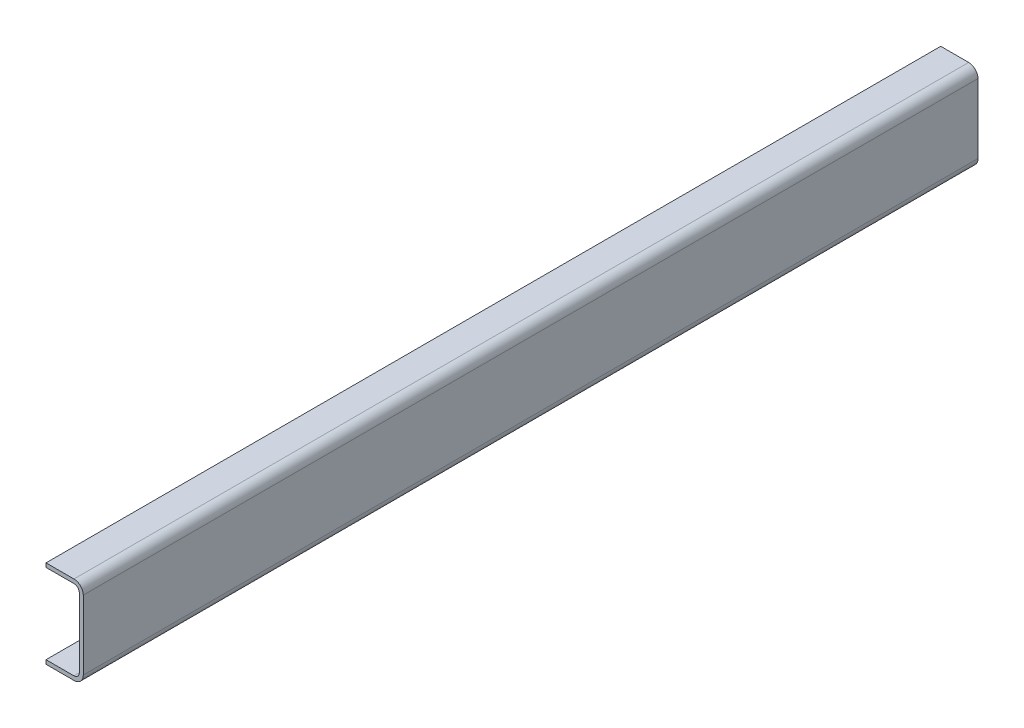
ISO-10303-21;
HEADER;
FILE_DESCRIPTION(('STEP AP214'),'2;1');
FILE_NAME('part.step','',(''),(''),'','','');
FILE_SCHEMA(('AUTOMOTIVE_DESIGN { 1 0 10303 214 1 1 1 1 }'));
ENDSEC;
DATA;
#1=APPLICATION_CONTEXT('core data for automotive mechanical design processes');
#2=APPLICATION_PROTOCOL_DEFINITION('international standard','automotive_design',2000,#1);
#3=PRODUCT_CONTEXT('',#1,'mechanical');
#4=PRODUCT('Part','Part','',(#3));
#5=PRODUCT_RELATED_PRODUCT_CATEGORY('part','',(#4));
#6=PRODUCT_DEFINITION_FORMATION('','',#4);
#7=PRODUCT_DEFINITION_CONTEXT('part definition',#1,'design');
#8=PRODUCT_DEFINITION('design','',#6,#7);
#9=PRODUCT_DEFINITION_SHAPE('','',#8);
#10=(LENGTH_UNIT() NAMED_UNIT(*) SI_UNIT(.MILLI.,.METRE.));
#11=(NAMED_UNIT(*) PLANE_ANGLE_UNIT() SI_UNIT($,.RADIAN.));
#12=(NAMED_UNIT(*) SI_UNIT($,.STERADIAN.) SOLID_ANGLE_UNIT());
#13=UNCERTAINTY_MEASURE_WITH_UNIT(LENGTH_MEASURE(1.E-05),#10,'distance_accuracy_value','');
#14=(GEOMETRIC_REPRESENTATION_CONTEXT(3) GLOBAL_UNCERTAINTY_ASSIGNED_CONTEXT((#13)) GLOBAL_UNIT_ASSIGNED_CONTEXT((#10,
#11,#12)) REPRESENTATION_CONTEXT('',''));
#15=CARTESIAN_POINT('',(0.,0.,0.));
#16=DIRECTION('',(0.,0.,1.));
#17=DIRECTION('',(1.,0.,0.));
#18=AXIS2_PLACEMENT_3D('',#15,#16,#17);
#19=CARTESIAN_POINT('',(-88.9,9.525,0.));
#20=DIRECTION('',(0.,0.,1.));
#21=DIRECTION('',(1.,0.,0.));
#22=AXIS2_PLACEMENT_3D('',#19,#20,#21);
#23=PLANE('',#22);
#24=DIRECTION('',(0.,-1.,0.));
#25=VECTOR('',#24,1.);
#26=CARTESIAN_POINT('',(0.,0.,0.));
#27=LINE('',#26,#25);
#28=CARTESIAN_POINT('',(0.,187.325,0.));
#29=VERTEX_POINT('',#28);
#30=CARTESIAN_POINT('',(0.,22.225,0.));
#31=VERTEX_POINT('',#30);
#32=EDGE_CURVE('E147',#29,#31,#27,.T.);
#33=ORIENTED_EDGE('',*,*,#32,.F.);
#34=CARTESIAN_POINT('',(-22.225,187.325,0.));
#35=DIRECTION('',(0.,0.,1.));
#36=DIRECTION('',(1.,0.,0.));
#37=AXIS2_PLACEMENT_3D('',#34,#35,#36);
#38=CIRCLE('',#37,22.225);
#39=CARTESIAN_POINT('',(-22.225,209.55,0.));
#40=VERTEX_POINT('',#39);
#41=EDGE_CURVE('E194',#29,#40,#38,.T.);
#42=ORIENTED_EDGE('',*,*,#41,.T.);
#43=DIRECTION('',(1.,0.,0.));
#44=VECTOR('',#43,1.);
#45=CARTESIAN_POINT('',(-88.9,209.55,0.));
#46=LINE('',#45,#44);
#47=CARTESIAN_POINT('',(-88.9,209.55,0.));
#48=VERTEX_POINT('',#47);
#49=EDGE_CURVE('E153',#48,#40,#46,.T.);
#50=ORIENTED_EDGE('',*,*,#49,.F.);
#51=DIRECTION('',(0.,1.,0.));
#52=VECTOR('',#51,1.);
#53=CARTESIAN_POINT('',(-88.9,200.025,0.));
#54=LINE('',#53,#52);
#55=CARTESIAN_POINT('',(-88.9,200.025,0.));
#56=VERTEX_POINT('',#55);
#57=EDGE_CURVE('E155',#56,#48,#54,.T.);
#58=ORIENTED_EDGE('',*,*,#57,.F.);
#59=DIRECTION('',(1.,0.,0.));
#60=VECTOR('',#59,1.);
#61=CARTESIAN_POINT('',(-88.9,200.025,0.));
#62=LINE('',#61,#60);
#63=CARTESIAN_POINT('',(-22.225,200.025,0.));
#64=VERTEX_POINT('',#63);
#65=EDGE_CURVE('E158',#56,#64,#62,.T.);
#66=ORIENTED_EDGE('',*,*,#65,.T.);
#67=CARTESIAN_POINT('',(-22.225,187.325,0.));
#68=DIRECTION('',(0.,0.,1.));
#69=DIRECTION('',(1.,0.,0.));
#70=AXIS2_PLACEMENT_3D('',#67,#68,#69);
#71=CIRCLE('',#70,12.7);
#72=CARTESIAN_POINT('',(-9.525,187.325,0.));
#73=VERTEX_POINT('',#72);
#74=EDGE_CURVE('E180',#64,#73,#71,.F.);
#75=ORIENTED_EDGE('',*,*,#74,.T.);
#76=DIRECTION('',(0.,1.,0.));
#77=VECTOR('',#76,1.);
#78=CARTESIAN_POINT('',(-9.525,0.,0.));
#79=LINE('',#78,#77);
#80=CARTESIAN_POINT('',(-9.525,22.225,0.));
#81=VERTEX_POINT('',#80);
#82=EDGE_CURVE('E140',#73,#81,#79,.F.);
#83=ORIENTED_EDGE('',*,*,#82,.T.);
#84=CARTESIAN_POINT('',(-22.225,22.225,0.));
#85=DIRECTION('',(0.,0.,1.));
#86=DIRECTION('',(1.,0.,0.));
#87=AXIS2_PLACEMENT_3D('',#84,#85,#86);
#88=CIRCLE('',#87,12.7);
#89=CARTESIAN_POINT('',(-22.225,9.525,0.));
#90=VERTEX_POINT('',#89);
#91=EDGE_CURVE('E128',#81,#90,#88,.F.);
#92=ORIENTED_EDGE('',*,*,#91,.T.);
#93=DIRECTION('',(1.,0.,0.));
#94=VECTOR('',#93,1.);
#95=CARTESIAN_POINT('',(-88.9,9.525,0.));
#96=LINE('',#95,#94);
#97=CARTESIAN_POINT('',(-88.9,9.525,0.));
#98=VERTEX_POINT('',#97);
#99=EDGE_CURVE('E121',#90,#98,#96,.F.);
#100=ORIENTED_EDGE('',*,*,#99,.T.);
#101=DIRECTION('',(0.,1.,0.));
#102=VECTOR('',#101,1.);
#103=CARTESIAN_POINT('',(-88.9,0.,0.));
#104=LINE('',#103,#102);
#105=CARTESIAN_POINT('',(-88.9,0.,0.));
#106=VERTEX_POINT('',#105);
#107=EDGE_CURVE('E126',#106,#98,#104,.T.);
#108=ORIENTED_EDGE('',*,*,#107,.F.);
#109=DIRECTION('',(-1.,0.,0.));
#110=VECTOR('',#109,1.);
#111=CARTESIAN_POINT('',(-88.9,0.,0.));
#112=LINE('',#111,#110);
#113=CARTESIAN_POINT('',(-22.225,0.,0.));
#114=VERTEX_POINT('',#113);
#115=EDGE_CURVE('E145',#114,#106,#112,.T.);
#116=ORIENTED_EDGE('',*,*,#115,.F.);
#117=CARTESIAN_POINT('',(-22.225,22.225,0.));
#118=DIRECTION('',(0.,0.,1.));
#119=DIRECTION('',(1.,0.,0.));
#120=AXIS2_PLACEMENT_3D('',#117,#118,#119);
#121=CIRCLE('',#120,22.225);
#122=EDGE_CURVE('E192',#114,#31,#121,.T.);
#123=ORIENTED_EDGE('',*,*,#122,.T.);
#124=EDGE_LOOP('',(#33,#42,#50,#58,#66,#75,#83,#92,#100,#108,#116,#123));
#125=FACE_BOUND('',#124,.T.);
#126=ADVANCED_FACE('F30',(#125),#23,.T.);
#127=CARTESIAN_POINT('',(-88.9,0.,-2361.22779377747));
#128=DIRECTION('',(1.,0.,0.));
#129=DIRECTION('',(0.,0.,-1.));
#130=AXIS2_PLACEMENT_3D('',#127,#128,#129);
#131=PLANE('',#130);
#132=DIRECTION('',(0.,0.,1.));
#133=VECTOR('',#132,1.);
#134=CARTESIAN_POINT('',(-88.9,9.525,-2361.22779377747));
#135=LINE('',#134,#133);
#136=CARTESIAN_POINT('',(-88.9,9.525,-2133.6));
#137=VERTEX_POINT('',#136);
#138=EDGE_CURVE('E134',#137,#98,#135,.T.);
#139=ORIENTED_EDGE('',*,*,#138,.F.);
#140=DIRECTION('',(0.,-1.,0.));
#141=VECTOR('',#140,1.);
#142=CARTESIAN_POINT('',(-88.9,0.,-2133.6));
#143=LINE('',#142,#141);
#144=CARTESIAN_POINT('',(-88.9,0.,-2133.6));
#145=VERTEX_POINT('',#144);
#146=EDGE_CURVE('E164',#137,#145,#143,.T.);
#147=ORIENTED_EDGE('',*,*,#146,.T.);
#148=DIRECTION('',(0.,0.,1.));
#149=VECTOR('',#148,1.);
#150=CARTESIAN_POINT('',(-88.9,0.,-2361.22779377747));
#151=LINE('',#150,#149);
#152=EDGE_CURVE('E139',#145,#106,#151,.T.);
#153=ORIENTED_EDGE('',*,*,#152,.T.);
#154=ORIENTED_EDGE('',*,*,#107,.T.);
#155=EDGE_LOOP('',(#139,#147,#153,#154));
#156=FACE_BOUND('',#155,.T.);
#157=ADVANCED_FACE('F143',(#156),#131,.F.);
#158=CARTESIAN_POINT('',(-88.9,0.,-2361.22779377747));
#159=DIRECTION('',(0.,1.,0.));
#160=DIRECTION('',(0.,0.,1.));
#161=AXIS2_PLACEMENT_3D('',#158,#159,#160);
#162=PLANE('',#161);
#163=DIRECTION('',(1.,0.,0.));
#164=VECTOR('',#163,1.);
#165=CARTESIAN_POINT('',(-88.9,0.,-2133.6));
#166=LINE('',#165,#164);
#167=CARTESIAN_POINT('',(-22.225,0.,-2133.6));
#168=VERTEX_POINT('',#167);
#169=EDGE_CURVE('E169',#145,#168,#166,.T.);
#170=ORIENTED_EDGE('',*,*,#169,.T.);
#171=DIRECTION('',(0.,0.,1.));
#172=VECTOR('',#171,1.);
#173=CARTESIAN_POINT('',(-22.225,0.,-2361.22779377747));
#174=LINE('',#173,#172);
#175=EDGE_CURVE('E11',#168,#114,#174,.T.);
#176=ORIENTED_EDGE('',*,*,#175,.T.);
#177=ORIENTED_EDGE('',*,*,#115,.T.);
#178=ORIENTED_EDGE('',*,*,#152,.F.);
#179=EDGE_LOOP('',(#170,#176,#177,#178));
#180=FACE_BOUND('',#179,.T.);
#181=ADVANCED_FACE('F246',(#180),#162,.F.);
#182=CARTESIAN_POINT('',(0.,0.,-2361.22779377747));
#183=DIRECTION('',(-1.,0.,0.));
#184=DIRECTION('',(0.,0.,1.));
#185=AXIS2_PLACEMENT_3D('',#182,#183,#184);
#186=PLANE('',#185);
#187=DIRECTION('',(0.,1.,0.));
#188=VECTOR('',#187,1.);
#189=CARTESIAN_POINT('',(0.,0.,-2133.6));
#190=LINE('',#189,#188);
#191=CARTESIAN_POINT('',(0.,22.225,-2133.6));
#192=VERTEX_POINT('',#191);
#193=CARTESIAN_POINT('',(0.,187.325,-2133.6));
#194=VERTEX_POINT('',#193);
#195=EDGE_CURVE('E200',#192,#194,#190,.T.);
#196=ORIENTED_EDGE('',*,*,#195,.T.);
#197=DIRECTION('',(0.,0.,1.));
#198=VECTOR('',#197,1.);
#199=CARTESIAN_POINT('',(0.,187.325,-2361.22779377747));
#200=LINE('',#199,#198);
#201=EDGE_CURVE('E189',#194,#29,#200,.T.);
#202=ORIENTED_EDGE('',*,*,#201,.T.);
#203=ORIENTED_EDGE('',*,*,#32,.T.);
#204=DIRECTION('',(0.,0.,1.));
#205=VECTOR('',#204,1.);
#206=CARTESIAN_POINT('',(0.,22.225,-2361.22779377747));
#207=LINE('',#206,#205);
#208=EDGE_CURVE('E187',#31,#192,#207,.F.);
#209=ORIENTED_EDGE('',*,*,#208,.T.);
#210=EDGE_LOOP('',(#196,#202,#203,#209));
#211=FACE_BOUND('',#210,.T.);
#212=ADVANCED_FACE('F206',(#211),#186,.F.);
#213=CARTESIAN_POINT('',(-88.9,209.55,-2361.22779377747));
#214=DIRECTION('',(0.,-1.,0.));
#215=DIRECTION('',(1.,0.,0.));
#216=AXIS2_PLACEMENT_3D('',#213,#214,#215);
#217=PLANE('',#216);
#218=ORIENTED_EDGE('',*,*,#49,.T.);
#219=DIRECTION('',(0.,0.,1.));
#220=VECTOR('',#219,1.);
#221=CARTESIAN_POINT('',(-22.225,209.55,-2361.22779377747));
#222=LINE('',#221,#220);
#223=CARTESIAN_POINT('',(-22.225,209.55,-2133.6));
#224=VERTEX_POINT('',#223);
#225=EDGE_CURVE('E53',#40,#224,#222,.F.);
#226=ORIENTED_EDGE('',*,*,#225,.T.);
#227=DIRECTION('',(-1.,0.,0.));
#228=VECTOR('',#227,1.);
#229=CARTESIAN_POINT('',(-88.9,209.55,-2133.6));
#230=LINE('',#229,#228);
#231=CARTESIAN_POINT('',(-88.9,209.55,-2133.6));
#232=VERTEX_POINT('',#231);
#233=EDGE_CURVE('E202',#224,#232,#230,.T.);
#234=ORIENTED_EDGE('',*,*,#233,.T.);
#235=DIRECTION('',(0.,0.,1.));
#236=VECTOR('',#235,1.);
#237=CARTESIAN_POINT('',(-88.9,209.55,-2361.22779377747));
#238=LINE('',#237,#236);
#239=EDGE_CURVE('E165',#232,#48,#238,.T.);
#240=ORIENTED_EDGE('',*,*,#239,.T.);
#241=EDGE_LOOP('',(#218,#226,#234,#240));
#242=FACE_BOUND('',#241,.T.);
#243=ADVANCED_FACE('F212',(#242),#217,.F.);
#244=CARTESIAN_POINT('',(-88.9,200.025,-2361.22779377747));
#245=DIRECTION('',(1.,0.,0.));
#246=DIRECTION('',(0.,0.,-1.));
#247=AXIS2_PLACEMENT_3D('',#244,#245,#246);
#248=PLANE('',#247);
#249=ORIENTED_EDGE('',*,*,#239,.F.);
#250=DIRECTION('',(0.,-1.,0.));
#251=VECTOR('',#250,1.);
#252=CARTESIAN_POINT('',(-88.9,200.025,-2133.6));
#253=LINE('',#252,#251);
#254=CARTESIAN_POINT('',(-88.9,200.025,-2133.6));
#255=VERTEX_POINT('',#254);
#256=EDGE_CURVE('E241',#232,#255,#253,.T.);
#257=ORIENTED_EDGE('',*,*,#256,.T.);
#258=DIRECTION('',(0.,0.,1.));
#259=VECTOR('',#258,1.);
#260=CARTESIAN_POINT('',(-88.9,200.025,-2361.22779377747));
#261=LINE('',#260,#259);
#262=EDGE_CURVE('E162',#255,#56,#261,.T.);
#263=ORIENTED_EDGE('',*,*,#262,.T.);
#264=ORIENTED_EDGE('',*,*,#57,.T.);
#265=EDGE_LOOP('',(#249,#257,#263,#264));
#266=FACE_BOUND('',#265,.T.);
#267=ADVANCED_FACE('F216',(#266),#248,.F.);
#268=CARTESIAN_POINT('',(-88.9,200.025,-2361.22779377747));
#269=DIRECTION('',(0.,-1.,0.));
#270=DIRECTION('',(1.,0.,0.));
#271=AXIS2_PLACEMENT_3D('',#268,#269,#270);
#272=PLANE('',#271);
#273=DIRECTION('',(-1.,0.,0.));
#274=VECTOR('',#273,1.);
#275=CARTESIAN_POINT('',(-88.9,200.025,-2133.6));
#276=LINE('',#275,#274);
#277=CARTESIAN_POINT('',(-22.225,200.025,-2133.6));
#278=VERTEX_POINT('',#277);
#279=EDGE_CURVE('E223',#278,#255,#276,.T.);
#280=ORIENTED_EDGE('',*,*,#279,.F.);
#281=DIRECTION('',(0.,0.,1.));
#282=VECTOR('',#281,1.);
#283=CARTESIAN_POINT('',(-22.225,200.025,0.));
#284=LINE('',#283,#282);
#285=EDGE_CURVE('E170',#278,#64,#284,.T.);
#286=ORIENTED_EDGE('',*,*,#285,.T.);
#287=ORIENTED_EDGE('',*,*,#65,.F.);
#288=ORIENTED_EDGE('',*,*,#262,.F.);
#289=EDGE_LOOP('',(#280,#286,#287,#288));
#290=FACE_BOUND('',#289,.T.);
#291=ADVANCED_FACE('F221',(#290),#272,.T.);
#292=CARTESIAN_POINT('',(-9.525,0.,-2361.22779377747));
#293=DIRECTION('',(-1.,0.,0.));
#294=DIRECTION('',(0.,0.,1.));
#295=AXIS2_PLACEMENT_3D('',#292,#293,#294);
#296=PLANE('',#295);
#297=ORIENTED_EDGE('',*,*,#82,.F.);
#298=DIRECTION('',(0.,0.,1.));
#299=VECTOR('',#298,1.);
#300=CARTESIAN_POINT('',(-9.525,187.325,-2133.6));
#301=LINE('',#300,#299);
#302=CARTESIAN_POINT('',(-9.525,187.325,-2133.6));
#303=VERTEX_POINT('',#302);
#304=EDGE_CURVE('E176',#73,#303,#301,.F.);
#305=ORIENTED_EDGE('',*,*,#304,.T.);
#306=DIRECTION('',(0.,1.,0.));
#307=VECTOR('',#306,1.);
#308=CARTESIAN_POINT('',(-9.525,0.,-2133.6));
#309=LINE('',#308,#307);
#310=CARTESIAN_POINT('',(-9.525,22.225,-2133.6));
#311=VERTEX_POINT('',#310);
#312=EDGE_CURVE('E234',#311,#303,#309,.T.);
#313=ORIENTED_EDGE('',*,*,#312,.F.);
#314=DIRECTION('',(0.,0.,1.));
#315=VECTOR('',#314,1.);
#316=CARTESIAN_POINT('',(-9.525,22.225,0.));
#317=LINE('',#316,#315);
#318=EDGE_CURVE('E173',#311,#81,#317,.T.);
#319=ORIENTED_EDGE('',*,*,#318,.T.);
#320=EDGE_LOOP('',(#297,#305,#313,#319));
#321=FACE_BOUND('',#320,.T.);
#322=ADVANCED_FACE('F230',(#321),#296,.T.);
#323=CARTESIAN_POINT('',(-88.9,9.525,-2361.22779377747));
#324=DIRECTION('',(0.,1.,0.));
#325=DIRECTION('',(0.,0.,1.));
#326=AXIS2_PLACEMENT_3D('',#323,#324,#325);
#327=PLANE('',#326);
#328=ORIENTED_EDGE('',*,*,#99,.F.);
#329=DIRECTION('',(0.,0.,1.));
#330=VECTOR('',#329,1.);
#331=CARTESIAN_POINT('',(-22.225,9.525,-2133.6));
#332=LINE('',#331,#330);
#333=CARTESIAN_POINT('',(-22.225,9.525,-2133.6));
#334=VERTEX_POINT('',#333);
#335=EDGE_CURVE('E178',#90,#334,#332,.F.);
#336=ORIENTED_EDGE('',*,*,#335,.T.);
#337=DIRECTION('',(1.,0.,0.));
#338=VECTOR('',#337,1.);
#339=CARTESIAN_POINT('',(-88.9,9.525,-2133.6));
#340=LINE('',#339,#338);
#341=EDGE_CURVE('E136',#137,#334,#340,.T.);
#342=ORIENTED_EDGE('',*,*,#341,.F.);
#343=ORIENTED_EDGE('',*,*,#138,.T.);
#344=EDGE_LOOP('',(#328,#336,#342,#343));
#345=FACE_BOUND('',#344,.T.);
#346=ADVANCED_FACE('F32',(#345),#327,.T.);
#347=CARTESIAN_POINT('',(0.,0.,-2133.6));
#348=DIRECTION('',(0.,0.,1.));
#349=DIRECTION('',(1.,0.,0.));
#350=AXIS2_PLACEMENT_3D('',#347,#348,#349);
#351=PLANE('',#350);
#352=ORIENTED_EDGE('',*,*,#233,.F.);
#353=CARTESIAN_POINT('',(-22.225,187.325,-2133.6));
#354=DIRECTION('',(0.,0.,1.));
#355=DIRECTION('',(1.,0.,0.));
#356=AXIS2_PLACEMENT_3D('',#353,#354,#355);
#357=CIRCLE('',#356,22.225);
#358=EDGE_CURVE('E38',#224,#194,#357,.F.);
#359=ORIENTED_EDGE('',*,*,#358,.T.);
#360=ORIENTED_EDGE('',*,*,#195,.F.);
#361=CARTESIAN_POINT('',(-22.225,22.225,-2133.6));
#362=DIRECTION('',(0.,0.,1.));
#363=DIRECTION('',(1.,0.,0.));
#364=AXIS2_PLACEMENT_3D('',#361,#362,#363);
#365=CIRCLE('',#364,22.225);
#366=EDGE_CURVE('E45',#192,#168,#365,.F.);
#367=ORIENTED_EDGE('',*,*,#366,.T.);
#368=ORIENTED_EDGE('',*,*,#169,.F.);
#369=ORIENTED_EDGE('',*,*,#146,.F.);
#370=ORIENTED_EDGE('',*,*,#341,.T.);
#371=CARTESIAN_POINT('',(-22.225,22.225,-2133.6));
#372=DIRECTION('',(0.,0.,1.));
#373=DIRECTION('',(1.,0.,0.));
#374=AXIS2_PLACEMENT_3D('',#371,#372,#373);
#375=CIRCLE('',#374,12.7);
#376=EDGE_CURVE('E185',#334,#311,#375,.T.);
#377=ORIENTED_EDGE('',*,*,#376,.T.);
#378=ORIENTED_EDGE('',*,*,#312,.T.);
#379=CARTESIAN_POINT('',(-22.225,187.325,-2133.6));
#380=DIRECTION('',(0.,0.,1.));
#381=DIRECTION('',(1.,0.,0.));
#382=AXIS2_PLACEMENT_3D('',#379,#380,#381);
#383=CIRCLE('',#382,12.7);
#384=EDGE_CURVE('E182',#303,#278,#383,.T.);
#385=ORIENTED_EDGE('',*,*,#384,.T.);
#386=ORIENTED_EDGE('',*,*,#279,.T.);
#387=ORIENTED_EDGE('',*,*,#256,.F.);
#388=EDGE_LOOP('',(#352,#359,#360,#367,#368,#369,#370,#377,#378,#385,#386,#387));
#389=FACE_BOUND('',#388,.T.);
#390=ADVANCED_FACE('F199',(#389),#351,.F.);
#391=CARTESIAN_POINT('',(-22.225,187.325,-2361.22779377747));
#392=DIRECTION('',(0.,0.,-1.));
#393=DIRECTION('',(-1.,0.,0.));
#394=AXIS2_PLACEMENT_3D('',#391,#392,#393);
#395=CYLINDRICAL_SURFACE('',#394,12.7);
#396=ORIENTED_EDGE('',*,*,#384,.F.);
#397=ORIENTED_EDGE('',*,*,#304,.F.);
#398=ORIENTED_EDGE('',*,*,#74,.F.);
#399=ORIENTED_EDGE('',*,*,#285,.F.);
#400=EDGE_LOOP('',(#396,#397,#398,#399));
#401=FACE_BOUND('',#400,.T.);
#402=ADVANCED_FACE('F226',(#401),#395,.F.);
#403=CARTESIAN_POINT('',(-22.225,22.225,-2361.22779377747));
#404=DIRECTION('',(0.,0.,-1.));
#405=DIRECTION('',(-1.,0.,0.));
#406=AXIS2_PLACEMENT_3D('',#403,#404,#405);
#407=CYLINDRICAL_SURFACE('',#406,12.7);
#408=ORIENTED_EDGE('',*,*,#376,.F.);
#409=ORIENTED_EDGE('',*,*,#335,.F.);
#410=ORIENTED_EDGE('',*,*,#91,.F.);
#411=ORIENTED_EDGE('',*,*,#318,.F.);
#412=EDGE_LOOP('',(#408,#409,#410,#411));
#413=FACE_BOUND('',#412,.T.);
#414=ADVANCED_FACE('F237',(#413),#407,.F.);
#415=CARTESIAN_POINT('',(-22.225,187.325,-2361.22779377747));
#416=DIRECTION('',(0.,0.,1.));
#417=DIRECTION('',(1.,0.,0.));
#418=AXIS2_PLACEMENT_3D('',#415,#416,#417);
#419=CYLINDRICAL_SURFACE('',#418,22.225);
#420=ORIENTED_EDGE('',*,*,#358,.F.);
#421=ORIENTED_EDGE('',*,*,#225,.F.);
#422=ORIENTED_EDGE('',*,*,#41,.F.);
#423=ORIENTED_EDGE('',*,*,#201,.F.);
#424=EDGE_LOOP('',(#420,#421,#422,#423));
#425=FACE_BOUND('',#424,.T.);
#426=ADVANCED_FACE('F209',(#425),#419,.T.);
#427=CARTESIAN_POINT('',(-22.225,22.225,-2361.22779377747));
#428=DIRECTION('',(0.,0.,1.));
#429=DIRECTION('',(1.,0.,0.));
#430=AXIS2_PLACEMENT_3D('',#427,#428,#429);
#431=CYLINDRICAL_SURFACE('',#430,22.225);
#432=ORIENTED_EDGE('',*,*,#366,.F.);
#433=ORIENTED_EDGE('',*,*,#208,.F.);
#434=ORIENTED_EDGE('',*,*,#122,.F.);
#435=ORIENTED_EDGE('',*,*,#175,.F.);
#436=EDGE_LOOP('',(#432,#433,#434,#435));
#437=FACE_BOUND('',#436,.T.);
#438=ADVANCED_FACE('F248',(#437),#431,.T.);
#439=CLOSED_SHELL('',(#126,#157,#181,#212,#243,#267,#291,#322,#346,#390,#402,#414,#426,#438));
#440=MANIFOLD_SOLID_BREP('B2',#439);
#441=ADVANCED_BREP_SHAPE_REPRESENTATION('',(#18,#440),#14);
#442=SHAPE_DEFINITION_REPRESENTATION(#9,#441);
ENDSEC;
END-ISO-10303-21;
